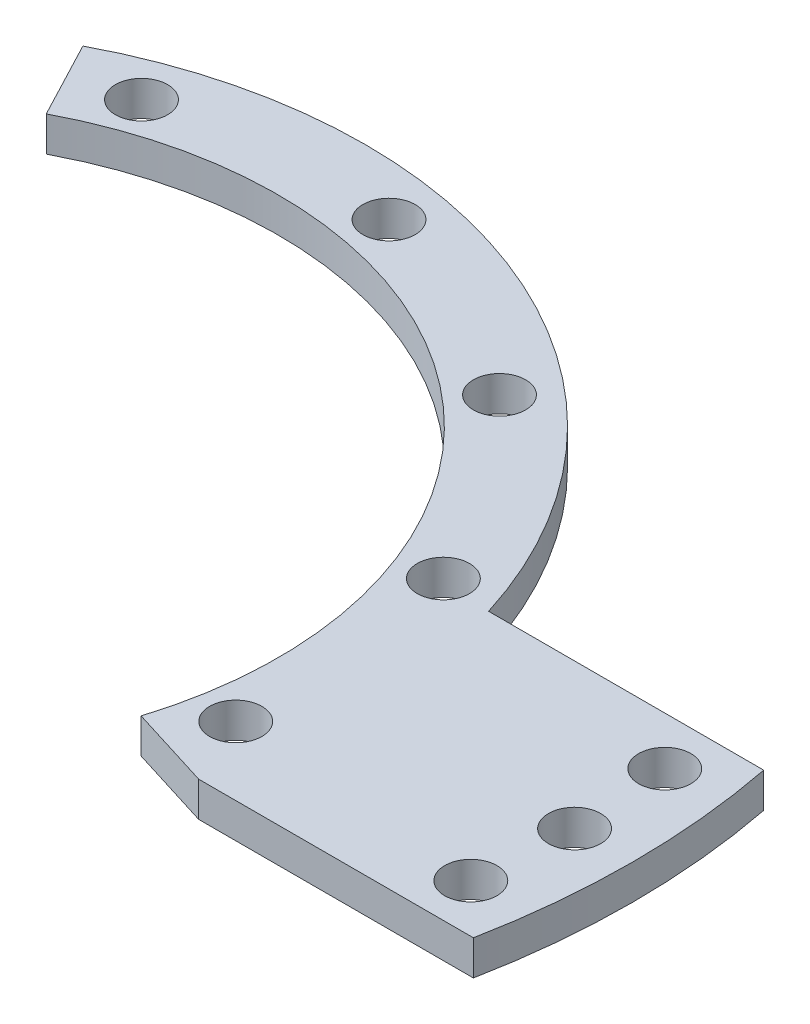
ISO-10303-21;
HEADER;
FILE_DESCRIPTION(('STEP AP214'),'2;1');
FILE_NAME('part.step','',(''),(''),'','','');
FILE_SCHEMA(('AUTOMOTIVE_DESIGN { 1 0 10303 214 1 1 1 1 }'));
ENDSEC;
DATA;
#1=APPLICATION_CONTEXT('core data for automotive mechanical design processes');
#2=APPLICATION_PROTOCOL_DEFINITION('international standard','automotive_design',2000,#1);
#3=PRODUCT_CONTEXT('',#1,'mechanical');
#4=PRODUCT('Part','Part','',(#3));
#5=PRODUCT_RELATED_PRODUCT_CATEGORY('part','',(#4));
#6=PRODUCT_DEFINITION_FORMATION('','',#4);
#7=PRODUCT_DEFINITION_CONTEXT('part definition',#1,'design');
#8=PRODUCT_DEFINITION('design','',#6,#7);
#9=PRODUCT_DEFINITION_SHAPE('','',#8);
#10=(LENGTH_UNIT() NAMED_UNIT(*) SI_UNIT(.MILLI.,.METRE.));
#11=(NAMED_UNIT(*) PLANE_ANGLE_UNIT() SI_UNIT($,.RADIAN.));
#12=(NAMED_UNIT(*) SI_UNIT($,.STERADIAN.) SOLID_ANGLE_UNIT());
#13=UNCERTAINTY_MEASURE_WITH_UNIT(LENGTH_MEASURE(1.E-05),#10,'distance_accuracy_value','');
#14=(GEOMETRIC_REPRESENTATION_CONTEXT(3) GLOBAL_UNCERTAINTY_ASSIGNED_CONTEXT((#13)) GLOBAL_UNIT_ASSIGNED_CONTEXT((#10,
#11,#12)) REPRESENTATION_CONTEXT('',''));
#15=CARTESIAN_POINT('',(0.,0.,0.));
#16=DIRECTION('',(0.,0.,1.));
#17=DIRECTION('',(1.,0.,0.));
#18=AXIS2_PLACEMENT_3D('',#15,#16,#17);
#19=CARTESIAN_POINT('',(0.,3.,0.));
#20=DIRECTION('',(0.,1.,0.));
#21=DIRECTION('',(0.,0.,1.));
#22=AXIS2_PLACEMENT_3D('',#19,#20,#21);
#23=PLANE('',#22);
#24=CARTESIAN_POINT('',(59.4160841244942,3.,-8.35038605760396));
#25=DIRECTION('',(0.,1.,0.));
#26=DIRECTION('',(0.,0.,1.));
#27=AXIS2_PLACEMENT_3D('',#24,#25,#26);
#28=CIRCLE('',#27,2.25);
#29=CARTESIAN_POINT('',(59.4160841244942,3.,-6.10038605760397));
#30=VERTEX_POINT('',#29);
#31=EDGE_CURVE('E163',#30,#30,#28,.T.);
#32=ORIENTED_EDGE('',*,*,#31,.F.);
#33=EDGE_LOOP('',(#32));
#34=FACE_BOUND('',#33,.T.);
#35=CARTESIAN_POINT('',(59.4160841244942,3.,8.35038605760396));
#36=DIRECTION('',(0.,1.,0.));
#37=DIRECTION('',(0.,0.,1.));
#38=AXIS2_PLACEMENT_3D('',#35,#36,#37);
#39=CIRCLE('',#38,2.25);
#40=CARTESIAN_POINT('',(59.4160841244942,3.,10.600386057604));
#41=VERTEX_POINT('',#40);
#42=EDGE_CURVE('E166',#41,#41,#39,.T.);
#43=ORIENTED_EDGE('',*,*,#42,.F.);
#44=EDGE_LOOP('',(#43));
#45=FACE_BOUND('',#44,.T.);
#46=CARTESIAN_POINT('',(60.,3.,0.));
#47=DIRECTION('',(0.,1.,0.));
#48=DIRECTION('',(0.,0.,1.));
#49=AXIS2_PLACEMENT_3D('',#46,#47,#48);
#50=CIRCLE('',#49,2.25);
#51=CARTESIAN_POINT('',(60.,3.,2.25));
#52=VERTEX_POINT('',#51);
#53=EDGE_CURVE('E162',#52,#52,#50,.T.);
#54=ORIENTED_EDGE('',*,*,#53,.F.);
#55=EDGE_LOOP('',(#54));
#56=FACE_BOUND('',#55,.T.);
#57=CARTESIAN_POINT('',(6.59863075134284,3.,-37.422694614464));
#58=DIRECTION('',(0.,1.,0.));
#59=DIRECTION('',(0.,0.,1.));
#60=AXIS2_PLACEMENT_3D('',#57,#58,#59);
#61=CIRCLE('',#60,2.25);
#62=CARTESIAN_POINT('',(6.59863075134284,3.,-35.172694614464));
#63=VERTEX_POINT('',#62);
#64=EDGE_CURVE('E144',#63,#63,#61,.T.);
#65=ORIENTED_EDGE('',*,*,#64,.F.);
#66=EDGE_LOOP('',(#65));
#67=FACE_BOUND('',#66,.T.);
#68=CARTESIAN_POINT('',(24.4259291680881,3.,-29.1096888385215));
#69=DIRECTION('',(0.,1.,0.));
#70=DIRECTION('',(0.,0.,1.));
#71=AXIS2_PLACEMENT_3D('',#68,#69,#70);
#72=CIRCLE('',#71,2.25);
#73=CARTESIAN_POINT('',(24.4259291680881,3.,-26.8596888385215));
#74=VERTEX_POINT('',#73);
#75=EDGE_CURVE('E156',#74,#74,#72,.T.);
#76=ORIENTED_EDGE('',*,*,#75,.F.);
#77=EDGE_LOOP('',(#76));
#78=FACE_BOUND('',#77,.T.);
#79=CARTESIAN_POINT('',(35.7083195898644,3.,-12.9967654463758));
#80=DIRECTION('',(0.,1.,0.));
#81=DIRECTION('',(0.,0.,1.));
#82=AXIS2_PLACEMENT_3D('',#79,#80,#81);
#83=CIRCLE('',#82,2.25);
#84=CARTESIAN_POINT('',(35.7083195898644,3.,-10.7467654463758));
#85=VERTEX_POINT('',#84);
#86=EDGE_CURVE('E152',#85,#85,#83,.T.);
#87=ORIENTED_EDGE('',*,*,#86,.F.);
#88=EDGE_LOOP('',(#87));
#89=FACE_BOUND('',#88,.T.);
#90=CARTESIAN_POINT('',(37.422694614464,3.,6.59863075134298));
#91=DIRECTION('',(0.,1.,0.));
#92=DIRECTION('',(0.,0.,1.));
#93=AXIS2_PLACEMENT_3D('',#90,#91,#92);
#94=CIRCLE('',#93,2.25);
#95=CARTESIAN_POINT('',(37.422694614464,3.,8.84863075134298));
#96=VERTEX_POINT('',#95);
#97=EDGE_CURVE('E148',#96,#96,#94,.T.);
#98=ORIENTED_EDGE('',*,*,#97,.F.);
#99=EDGE_LOOP('',(#98));
#100=FACE_BOUND('',#99,.T.);
#101=CARTESIAN_POINT('',(-12.9967654463754,3.,-35.7083195898645));
#102=DIRECTION('',(0.,1.,0.));
#103=DIRECTION('',(0.,0.,1.));
#104=AXIS2_PLACEMENT_3D('',#101,#102,#103);
#105=CIRCLE('',#104,2.25);
#106=CARTESIAN_POINT('',(-12.9967654463754,3.,-33.4583195898645));
#107=VERTEX_POINT('',#106);
#108=EDGE_CURVE('E143',#107,#107,#105,.T.);
#109=ORIENTED_EDGE('',*,*,#108,.F.);
#110=EDGE_LOOP('',(#109));
#111=FACE_BOUND('',#110,.T.);
#112=DIRECTION('',(1.,0.,0.));
#113=VECTOR('',#112,1.);
#114=CARTESIAN_POINT('',(70.,3.,12.5));
#115=LINE('',#114,#113);
#116=CARTESIAN_POINT('',(40.0967579736816,3.,12.5));
#117=VERTEX_POINT('',#116);
#118=CARTESIAN_POINT('',(63.7867541108654,3.,12.5));
#119=VERTEX_POINT('',#118);
#120=EDGE_CURVE('E110',#117,#119,#115,.T.);
#121=ORIENTED_EDGE('',*,*,#120,.T.);
#122=CARTESIAN_POINT('',(0.,3.,0.));
#123=DIRECTION('',(0.,1.,0.));
#124=DIRECTION('',(0.,0.,1.));
#125=AXIS2_PLACEMENT_3D('',#122,#123,#124);
#126=CIRCLE('',#125,65.);
#127=CARTESIAN_POINT('',(63.7867541108654,3.,-12.5));
#128=VERTEX_POINT('',#127);
#129=EDGE_CURVE('E98',#119,#128,#126,.T.);
#130=ORIENTED_EDGE('',*,*,#129,.T.);
#131=DIRECTION('',(-1.,0.,0.));
#132=VECTOR('',#131,1.);
#133=CARTESIAN_POINT('',(70.,3.,-12.5));
#134=LINE('',#133,#132);
#135=CARTESIAN_POINT('',(40.0967579736816,3.,-12.5));
#136=VERTEX_POINT('',#135);
#137=EDGE_CURVE('E106',#128,#136,#134,.T.);
#138=ORIENTED_EDGE('',*,*,#137,.T.);
#139=CARTESIAN_POINT('',(0.,3.,0.));
#140=DIRECTION('',(0.,1.,0.));
#141=DIRECTION('',(0.,0.,1.));
#142=AXIS2_PLACEMENT_3D('',#139,#140,#141);
#143=CIRCLE('',#142,42.);
#144=CARTESIAN_POINT('',(-19.5233659204339,3.,-37.1865322816855));
#145=VERTEX_POINT('',#144);
#146=EDGE_CURVE('E136',#136,#145,#143,.T.);
#147=ORIENTED_EDGE('',*,*,#146,.T.);
#148=DIRECTION('',(-0.464842045724618,0.,-0.885393625754417));
#149=VECTOR('',#148,1.);
#150=CARTESIAN_POINT('',(0.,3.,0.));
#151=LINE('',#150,#149);
#152=CARTESIAN_POINT('',(-16.0370505774993,3.,-30.5460800885274));
#153=VERTEX_POINT('',#152);
#154=EDGE_CURVE('E210',#153,#145,#151,.T.);
#155=ORIENTED_EDGE('',*,*,#154,.F.);
#156=CARTESIAN_POINT('',(0.,3.,0.));
#157=DIRECTION('',(0.,1.,0.));
#158=DIRECTION('',(0.,0.,1.));
#159=AXIS2_PLACEMENT_3D('',#156,#157,#158);
#160=CIRCLE('',#159,34.5);
#161=CARTESIAN_POINT('',(32.9392475828465,3.,10.2594331556836));
#162=VERTEX_POINT('',#161);
#163=EDGE_CURVE('E127',#162,#153,#160,.T.);
#164=ORIENTED_EDGE('',*,*,#163,.F.);
#165=DIRECTION('',(-0.954760799502797,0.,-0.297374874077787));
#166=VECTOR('',#165,1.);
#167=CARTESIAN_POINT('',(0.,3.,0.));
#168=LINE('',#167,#166);
#169=CARTESIAN_POINT('',(40.0999535791175,3.,12.489744711267));
#170=VERTEX_POINT('',#169);
#171=EDGE_CURVE('E206',#170,#162,#168,.T.);
#172=ORIENTED_EDGE('',*,*,#171,.F.);
#173=CARTESIAN_POINT('',(0.,3.,0.));
#174=DIRECTION('',(0.,1.,0.));
#175=DIRECTION('',(0.,0.,1.));
#176=AXIS2_PLACEMENT_3D('',#173,#174,#175);
#177=CIRCLE('',#176,42.);
#178=EDGE_CURVE('E214',#117,#170,#177,.T.);
#179=ORIENTED_EDGE('',*,*,#178,.F.);
#180=EDGE_LOOP('',(#121,#130,#138,#147,#155,#164,#172,#179));
#181=FACE_BOUND('',#180,.T.);
#182=ADVANCED_FACE('F33',(#34,#45,#56,#67,#78,#89,#100,#111,#181),#23,.T.);
#183=CARTESIAN_POINT('',(0.,0.,0.));
#184=DIRECTION('',(0.,1.,0.));
#185=DIRECTION('',(0.,0.,1.));
#186=AXIS2_PLACEMENT_3D('',#183,#184,#185);
#187=PLANE('',#186);
#188=CARTESIAN_POINT('',(59.4160841244942,0.,-8.35038605760396));
#189=DIRECTION('',(0.,1.,0.));
#190=DIRECTION('',(0.,0.,1.));
#191=AXIS2_PLACEMENT_3D('',#188,#189,#190);
#192=CIRCLE('',#191,2.25);
#193=CARTESIAN_POINT('',(59.4160841244942,0.,-6.10038605760397));
#194=VERTEX_POINT('',#193);
#195=EDGE_CURVE('E37',#194,#194,#192,.T.);
#196=ORIENTED_EDGE('',*,*,#195,.T.);
#197=EDGE_LOOP('',(#196));
#198=FACE_BOUND('',#197,.T.);
#199=CARTESIAN_POINT('',(59.4160841244942,0.,8.35038605760396));
#200=DIRECTION('',(0.,1.,0.));
#201=DIRECTION('',(0.,0.,1.));
#202=AXIS2_PLACEMENT_3D('',#199,#200,#201);
#203=CIRCLE('',#202,2.25);
#204=CARTESIAN_POINT('',(59.4160841244942,0.,10.600386057604));
#205=VERTEX_POINT('',#204);
#206=EDGE_CURVE('E164',#205,#205,#203,.T.);
#207=ORIENTED_EDGE('',*,*,#206,.T.);
#208=EDGE_LOOP('',(#207));
#209=FACE_BOUND('',#208,.T.);
#210=CARTESIAN_POINT('',(60.,0.,0.));
#211=DIRECTION('',(0.,1.,0.));
#212=DIRECTION('',(0.,0.,1.));
#213=AXIS2_PLACEMENT_3D('',#210,#211,#212);
#214=CIRCLE('',#213,2.25);
#215=CARTESIAN_POINT('',(60.,0.,2.25));
#216=VERTEX_POINT('',#215);
#217=EDGE_CURVE('E160',#216,#216,#214,.T.);
#218=ORIENTED_EDGE('',*,*,#217,.T.);
#219=EDGE_LOOP('',(#218));
#220=FACE_BOUND('',#219,.T.);
#221=CARTESIAN_POINT('',(-12.9967654463754,0.,-35.7083195898645));
#222=DIRECTION('',(0.,1.,0.));
#223=DIRECTION('',(0.,0.,1.));
#224=AXIS2_PLACEMENT_3D('',#221,#222,#223);
#225=CIRCLE('',#224,2.25);
#226=CARTESIAN_POINT('',(-12.9967654463754,0.,-33.4583195898645));
#227=VERTEX_POINT('',#226);
#228=EDGE_CURVE('E140',#227,#227,#225,.T.);
#229=ORIENTED_EDGE('',*,*,#228,.T.);
#230=EDGE_LOOP('',(#229));
#231=FACE_BOUND('',#230,.T.);
#232=CARTESIAN_POINT('',(37.422694614464,0.,6.59863075134298));
#233=DIRECTION('',(0.,1.,0.));
#234=DIRECTION('',(0.,0.,1.));
#235=AXIS2_PLACEMENT_3D('',#232,#233,#234);
#236=CIRCLE('',#235,2.25);
#237=CARTESIAN_POINT('',(37.422694614464,0.,8.84863075134298));
#238=VERTEX_POINT('',#237);
#239=EDGE_CURVE('E145',#238,#238,#236,.T.);
#240=ORIENTED_EDGE('',*,*,#239,.T.);
#241=EDGE_LOOP('',(#240));
#242=FACE_BOUND('',#241,.T.);
#243=CARTESIAN_POINT('',(35.7083195898644,0.,-12.9967654463758));
#244=DIRECTION('',(0.,1.,0.));
#245=DIRECTION('',(0.,0.,1.));
#246=AXIS2_PLACEMENT_3D('',#243,#244,#245);
#247=CIRCLE('',#246,2.25);
#248=CARTESIAN_POINT('',(35.7083195898644,0.,-10.7467654463758));
#249=VERTEX_POINT('',#248);
#250=EDGE_CURVE('E149',#249,#249,#247,.T.);
#251=ORIENTED_EDGE('',*,*,#250,.T.);
#252=EDGE_LOOP('',(#251));
#253=FACE_BOUND('',#252,.T.);
#254=CARTESIAN_POINT('',(24.4259291680881,0.,-29.1096888385215));
#255=DIRECTION('',(0.,1.,0.));
#256=DIRECTION('',(0.,0.,1.));
#257=AXIS2_PLACEMENT_3D('',#254,#255,#256);
#258=CIRCLE('',#257,2.25);
#259=CARTESIAN_POINT('',(24.4259291680881,0.,-26.8596888385215));
#260=VERTEX_POINT('',#259);
#261=EDGE_CURVE('E153',#260,#260,#258,.T.);
#262=ORIENTED_EDGE('',*,*,#261,.T.);
#263=EDGE_LOOP('',(#262));
#264=FACE_BOUND('',#263,.T.);
#265=CARTESIAN_POINT('',(6.59863075134284,0.,-37.422694614464));
#266=DIRECTION('',(0.,1.,0.));
#267=DIRECTION('',(0.,0.,1.));
#268=AXIS2_PLACEMENT_3D('',#265,#266,#267);
#269=CIRCLE('',#268,2.25);
#270=CARTESIAN_POINT('',(6.59863075134284,0.,-35.172694614464));
#271=VERTEX_POINT('',#270);
#272=EDGE_CURVE('E157',#271,#271,#269,.T.);
#273=ORIENTED_EDGE('',*,*,#272,.T.);
#274=EDGE_LOOP('',(#273));
#275=FACE_BOUND('',#274,.T.);
#276=CARTESIAN_POINT('',(0.,0.,0.));
#277=DIRECTION('',(0.,1.,0.));
#278=DIRECTION('',(0.,0.,1.));
#279=AXIS2_PLACEMENT_3D('',#276,#277,#278);
#280=CIRCLE('',#279,65.);
#281=CARTESIAN_POINT('',(63.7867541108654,0.,12.5));
#282=VERTEX_POINT('',#281);
#283=CARTESIAN_POINT('',(63.7867541108654,0.,-12.5));
#284=VERTEX_POINT('',#283);
#285=EDGE_CURVE('E49',#282,#284,#280,.T.);
#286=ORIENTED_EDGE('',*,*,#285,.F.);
#287=DIRECTION('',(1.,0.,0.));
#288=VECTOR('',#287,1.);
#289=CARTESIAN_POINT('',(70.,0.,12.5));
#290=LINE('',#289,#288);
#291=CARTESIAN_POINT('',(40.0967579736816,0.,12.5));
#292=VERTEX_POINT('',#291);
#293=EDGE_CURVE('E124',#292,#282,#290,.T.);
#294=ORIENTED_EDGE('',*,*,#293,.F.);
#295=CARTESIAN_POINT('',(0.,0.,0.));
#296=DIRECTION('',(0.,1.,0.));
#297=DIRECTION('',(0.,0.,-1.));
#298=AXIS2_PLACEMENT_3D('',#295,#296,#297);
#299=CIRCLE('',#298,42.);
#300=CARTESIAN_POINT('',(40.0999535791175,0.,12.489744711267));
#301=VERTEX_POINT('',#300);
#302=EDGE_CURVE('E192',#292,#301,#299,.T.);
#303=ORIENTED_EDGE('',*,*,#302,.T.);
#304=DIRECTION('',(-0.954760799502797,0.,-0.297374874077787));
#305=VECTOR('',#304,1.);
#306=CARTESIAN_POINT('',(0.,0.,0.));
#307=LINE('',#306,#305);
#308=CARTESIAN_POINT('',(32.9392475828465,0.,10.2594331556836));
#309=VERTEX_POINT('',#308);
#310=EDGE_CURVE('E195',#301,#309,#307,.T.);
#311=ORIENTED_EDGE('',*,*,#310,.T.);
#312=CARTESIAN_POINT('',(0.,0.,0.));
#313=DIRECTION('',(0.,1.,0.));
#314=DIRECTION('',(0.,0.,1.));
#315=AXIS2_PLACEMENT_3D('',#312,#313,#314);
#316=CIRCLE('',#315,34.5);
#317=CARTESIAN_POINT('',(-16.0370505774993,0.,-30.5460800885274));
#318=VERTEX_POINT('',#317);
#319=EDGE_CURVE('E220',#309,#318,#316,.T.);
#320=ORIENTED_EDGE('',*,*,#319,.T.);
#321=DIRECTION('',(-0.464842045724618,0.,-0.885393625754417));
#322=VECTOR('',#321,1.);
#323=CARTESIAN_POINT('',(-19.5233659204339,0.,-37.1865322816855));
#324=LINE('',#323,#322);
#325=CARTESIAN_POINT('',(-19.5233659204339,0.,-37.1865322816855));
#326=VERTEX_POINT('',#325);
#327=EDGE_CURVE('E57',#318,#326,#324,.T.);
#328=ORIENTED_EDGE('',*,*,#327,.T.);
#329=CARTESIAN_POINT('',(0.,0.,0.));
#330=DIRECTION('',(0.,1.,0.));
#331=DIRECTION('',(0.,0.,1.));
#332=AXIS2_PLACEMENT_3D('',#329,#330,#331);
#333=CIRCLE('',#332,42.);
#334=CARTESIAN_POINT('',(40.0967579736816,0.,-12.5));
#335=VERTEX_POINT('',#334);
#336=EDGE_CURVE('E131',#335,#326,#333,.T.);
#337=ORIENTED_EDGE('',*,*,#336,.F.);
#338=DIRECTION('',(-1.,0.,0.));
#339=VECTOR('',#338,1.);
#340=CARTESIAN_POINT('',(70.,0.,-12.5));
#341=LINE('',#340,#339);
#342=EDGE_CURVE('E120',#284,#335,#341,.T.);
#343=ORIENTED_EDGE('',*,*,#342,.F.);
#344=EDGE_LOOP('',(#286,#294,#303,#311,#320,#328,#337,#343));
#345=FACE_BOUND('',#344,.T.);
#346=ADVANCED_FACE('F235',(#198,#209,#220,#231,#242,#253,#264,#275,#345),#187,.F.);
#347=CARTESIAN_POINT('',(70.,3.,12.5));
#348=DIRECTION('',(0.,0.,-1.));
#349=DIRECTION('',(-1.,0.,0.));
#350=AXIS2_PLACEMENT_3D('',#347,#348,#349);
#351=PLANE('',#350);
#352=DIRECTION('',(0.,1.,0.));
#353=VECTOR('',#352,1.);
#354=CARTESIAN_POINT('',(63.7867541108654,-2.5E-05,12.5));
#355=LINE('',#354,#353);
#356=EDGE_CURVE('E111',#119,#282,#355,.F.);
#357=ORIENTED_EDGE('',*,*,#356,.F.);
#358=ORIENTED_EDGE('',*,*,#120,.F.);
#359=DIRECTION('',(0.,-1.,0.));
#360=VECTOR('',#359,1.);
#361=CARTESIAN_POINT('',(40.0967579736816,3.,12.5));
#362=LINE('',#361,#360);
#363=EDGE_CURVE('E118',#117,#292,#362,.T.);
#364=ORIENTED_EDGE('',*,*,#363,.T.);
#365=ORIENTED_EDGE('',*,*,#293,.T.);
#366=EDGE_LOOP('',(#357,#358,#364,#365));
#367=FACE_BOUND('',#366,.T.);
#368=ADVANCED_FACE('F243',(#367),#351,.F.);
#369=CARTESIAN_POINT('',(70.,3.,-12.5));
#370=DIRECTION('',(0.,0.,1.));
#371=DIRECTION('',(1.,0.,0.));
#372=AXIS2_PLACEMENT_3D('',#369,#370,#371);
#373=PLANE('',#372);
#374=DIRECTION('',(0.,1.,0.));
#375=VECTOR('',#374,1.);
#376=CARTESIAN_POINT('',(63.7867541108654,-2.5E-05,-12.5));
#377=LINE('',#376,#375);
#378=EDGE_CURVE('E11',#284,#128,#377,.T.);
#379=ORIENTED_EDGE('',*,*,#378,.F.);
#380=ORIENTED_EDGE('',*,*,#342,.T.);
#381=DIRECTION('',(0.,-1.,0.));
#382=VECTOR('',#381,1.);
#383=CARTESIAN_POINT('',(40.0967579736816,3.,-12.5));
#384=LINE('',#383,#382);
#385=EDGE_CURVE('E116',#335,#136,#384,.F.);
#386=ORIENTED_EDGE('',*,*,#385,.T.);
#387=ORIENTED_EDGE('',*,*,#137,.F.);
#388=EDGE_LOOP('',(#379,#380,#386,#387));
#389=FACE_BOUND('',#388,.T.);
#390=ADVANCED_FACE('F114',(#389),#373,.F.);
#391=CARTESIAN_POINT('',(0.,3.,0.));
#392=DIRECTION('',(0.,-1.,0.));
#393=DIRECTION('',(0.,0.,-1.));
#394=AXIS2_PLACEMENT_3D('',#391,#392,#393);
#395=CYLINDRICAL_SURFACE('',#394,42.);
#396=ORIENTED_EDGE('',*,*,#336,.T.);
#397=DIRECTION('',(0.,1.,0.));
#398=VECTOR('',#397,1.);
#399=CARTESIAN_POINT('',(-19.5233659204339,0.,-37.1865322816855));
#400=LINE('',#399,#398);
#401=EDGE_CURVE('E198',#326,#145,#400,.T.);
#402=ORIENTED_EDGE('',*,*,#401,.T.);
#403=ORIENTED_EDGE('',*,*,#146,.F.);
#404=ORIENTED_EDGE('',*,*,#385,.F.);
#405=EDGE_LOOP('',(#396,#402,#403,#404));
#406=FACE_BOUND('',#405,.T.);
#407=ADVANCED_FACE('F35',(#406),#395,.T.);
#408=CARTESIAN_POINT('',(0.,0.,0.));
#409=DIRECTION('',(0.,1.,0.));
#410=DIRECTION('',(0.,0.,1.));
#411=AXIS2_PLACEMENT_3D('',#408,#409,#410);
#412=CYLINDRICAL_SURFACE('',#411,34.5);
#413=ORIENTED_EDGE('',*,*,#163,.T.);
#414=DIRECTION('',(0.,1.,0.));
#415=VECTOR('',#414,1.);
#416=CARTESIAN_POINT('',(-16.0370505774993,0.,-30.5460800885274));
#417=LINE('',#416,#415);
#418=EDGE_CURVE('E42',#153,#318,#417,.F.);
#419=ORIENTED_EDGE('',*,*,#418,.T.);
#420=ORIENTED_EDGE('',*,*,#319,.F.);
#421=DIRECTION('',(0.,1.,0.));
#422=VECTOR('',#421,1.);
#423=CARTESIAN_POINT('',(32.9392475828465,0.,10.2594331556836));
#424=LINE('',#423,#422);
#425=EDGE_CURVE('E139',#309,#162,#424,.T.);
#426=ORIENTED_EDGE('',*,*,#425,.T.);
#427=EDGE_LOOP('',(#413,#419,#420,#426));
#428=FACE_BOUND('',#427,.T.);
#429=ADVANCED_FACE('F226',(#428),#412,.F.);
#430=CARTESIAN_POINT('',(0.,0.,0.));
#431=DIRECTION('',(0.297374874077787,0.,-0.954760799502797));
#432=DIRECTION('',(-0.954760799502797,0.,-0.297374874077787));
#433=AXIS2_PLACEMENT_3D('',#430,#431,#432);
#434=PLANE('',#433);
#435=ORIENTED_EDGE('',*,*,#171,.T.);
#436=ORIENTED_EDGE('',*,*,#425,.F.);
#437=ORIENTED_EDGE('',*,*,#310,.F.);
#438=DIRECTION('',(0.,1.,0.));
#439=VECTOR('',#438,1.);
#440=CARTESIAN_POINT('',(40.0999535791175,0.,12.489744711267));
#441=LINE('',#440,#439);
#442=EDGE_CURVE('E201',#301,#170,#441,.T.);
#443=ORIENTED_EDGE('',*,*,#442,.T.);
#444=EDGE_LOOP('',(#435,#436,#437,#443));
#445=FACE_BOUND('',#444,.T.);
#446=ADVANCED_FACE('F239',(#445),#434,.F.);
#447=CARTESIAN_POINT('',(0.,0.,0.));
#448=DIRECTION('',(0.,1.,0.));
#449=DIRECTION('',(0.,0.,1.));
#450=AXIS2_PLACEMENT_3D('',#447,#448,#449);
#451=CYLINDRICAL_SURFACE('',#450,42.);
#452=ORIENTED_EDGE('',*,*,#178,.T.);
#453=ORIENTED_EDGE('',*,*,#442,.F.);
#454=ORIENTED_EDGE('',*,*,#302,.F.);
#455=ORIENTED_EDGE('',*,*,#363,.F.);
#456=EDGE_LOOP('',(#452,#453,#454,#455));
#457=FACE_BOUND('',#456,.T.);
#458=ADVANCED_FACE('F241',(#457),#451,.F.);
#459=CARTESIAN_POINT('',(-19.5233659204339,0.,-37.1865322816855));
#460=DIRECTION('',(0.885393625754417,0.,-0.464842045724618));
#461=DIRECTION('',(-0.464842045724618,0.,-0.885393625754417));
#462=AXIS2_PLACEMENT_3D('',#459,#460,#461);
#463=PLANE('',#462);
#464=ORIENTED_EDGE('',*,*,#154,.T.);
#465=ORIENTED_EDGE('',*,*,#401,.F.);
#466=ORIENTED_EDGE('',*,*,#327,.F.);
#467=ORIENTED_EDGE('',*,*,#418,.F.);
#468=EDGE_LOOP('',(#464,#465,#466,#467));
#469=FACE_BOUND('',#468,.T.);
#470=ADVANCED_FACE('F230',(#469),#463,.F.);
#471=CARTESIAN_POINT('',(-12.9967654463754,-2.49999999998515E-05,-35.7083195898645));
#472=DIRECTION('',(0.,1.,0.));
#473=DIRECTION('',(0.,0.,1.));
#474=AXIS2_PLACEMENT_3D('',#471,#472,#473);
#475=CYLINDRICAL_SURFACE('',#474,2.25);
#476=ORIENTED_EDGE('',*,*,#108,.T.);
#477=EDGE_LOOP('',(#476));
#478=FACE_BOUND('',#477,.T.);
#479=ORIENTED_EDGE('',*,*,#228,.F.);
#480=EDGE_LOOP('',(#479));
#481=FACE_BOUND('',#480,.T.);
#482=ADVANCED_FACE('F272',(#478,#481),#475,.F.);
#483=CARTESIAN_POINT('',(37.422694614464,-2.49999999998515E-05,6.59863075134298));
#484=DIRECTION('',(0.,1.,0.));
#485=DIRECTION('',(0.,0.,1.));
#486=AXIS2_PLACEMENT_3D('',#483,#484,#485);
#487=CYLINDRICAL_SURFACE('',#486,2.25);
#488=ORIENTED_EDGE('',*,*,#97,.T.);
#489=EDGE_LOOP('',(#488));
#490=FACE_BOUND('',#489,.T.);
#491=ORIENTED_EDGE('',*,*,#239,.F.);
#492=EDGE_LOOP('',(#491));
#493=FACE_BOUND('',#492,.T.);
#494=ADVANCED_FACE('F275',(#490,#493),#487,.F.);
#495=CARTESIAN_POINT('',(35.7083195898644,-2.49999999998515E-05,-12.9967654463758));
#496=DIRECTION('',(0.,1.,0.));
#497=DIRECTION('',(0.,0.,1.));
#498=AXIS2_PLACEMENT_3D('',#495,#496,#497);
#499=CYLINDRICAL_SURFACE('',#498,2.25);
#500=ORIENTED_EDGE('',*,*,#86,.T.);
#501=EDGE_LOOP('',(#500));
#502=FACE_BOUND('',#501,.T.);
#503=ORIENTED_EDGE('',*,*,#250,.F.);
#504=EDGE_LOOP('',(#503));
#505=FACE_BOUND('',#504,.T.);
#506=ADVANCED_FACE('F299',(#502,#505),#499,.F.);
#507=CARTESIAN_POINT('',(24.4259291680881,-2.49999999998515E-05,-29.1096888385215));
#508=DIRECTION('',(0.,1.,0.));
#509=DIRECTION('',(0.,0.,1.));
#510=AXIS2_PLACEMENT_3D('',#507,#508,#509);
#511=CYLINDRICAL_SURFACE('',#510,2.25);
#512=ORIENTED_EDGE('',*,*,#75,.T.);
#513=EDGE_LOOP('',(#512));
#514=FACE_BOUND('',#513,.T.);
#515=ORIENTED_EDGE('',*,*,#261,.F.);
#516=EDGE_LOOP('',(#515));
#517=FACE_BOUND('',#516,.T.);
#518=ADVANCED_FACE('F290',(#514,#517),#511,.F.);
#519=CARTESIAN_POINT('',(6.59863075134284,-2.49999999998515E-05,-37.422694614464));
#520=DIRECTION('',(0.,1.,0.));
#521=DIRECTION('',(0.,0.,1.));
#522=AXIS2_PLACEMENT_3D('',#519,#520,#521);
#523=CYLINDRICAL_SURFACE('',#522,2.25);
#524=ORIENTED_EDGE('',*,*,#64,.T.);
#525=EDGE_LOOP('',(#524));
#526=FACE_BOUND('',#525,.T.);
#527=ORIENTED_EDGE('',*,*,#272,.F.);
#528=EDGE_LOOP('',(#527));
#529=FACE_BOUND('',#528,.T.);
#530=ADVANCED_FACE('F288',(#526,#529),#523,.F.);
#531=CARTESIAN_POINT('',(0.,-2.5E-05,0.));
#532=DIRECTION('',(0.,1.,0.));
#533=DIRECTION('',(0.,0.,1.));
#534=AXIS2_PLACEMENT_3D('',#531,#532,#533);
#535=CYLINDRICAL_SURFACE('',#534,65.);
#536=ORIENTED_EDGE('',*,*,#356,.T.);
#537=ORIENTED_EDGE('',*,*,#285,.T.);
#538=ORIENTED_EDGE('',*,*,#378,.T.);
#539=ORIENTED_EDGE('',*,*,#129,.F.);
#540=EDGE_LOOP('',(#536,#537,#538,#539));
#541=FACE_BOUND('',#540,.T.);
#542=ADVANCED_FACE('F97',(#541),#535,.T.);
#543=CARTESIAN_POINT('',(60.,-2.49999999998515E-05,0.));
#544=DIRECTION('',(0.,1.,0.));
#545=DIRECTION('',(0.,0.,1.));
#546=AXIS2_PLACEMENT_3D('',#543,#544,#545);
#547=CYLINDRICAL_SURFACE('',#546,2.25);
#548=ORIENTED_EDGE('',*,*,#53,.T.);
#549=EDGE_LOOP('',(#548));
#550=FACE_BOUND('',#549,.T.);
#551=ORIENTED_EDGE('',*,*,#217,.F.);
#552=EDGE_LOOP('',(#551));
#553=FACE_BOUND('',#552,.T.);
#554=ADVANCED_FACE('F297',(#550,#553),#547,.F.);
#555=CARTESIAN_POINT('',(59.4160841244942,-2.49999999998515E-05,8.35038605760396));
#556=DIRECTION('',(0.,1.,0.));
#557=DIRECTION('',(0.,0.,1.));
#558=AXIS2_PLACEMENT_3D('',#555,#556,#557);
#559=CYLINDRICAL_SURFACE('',#558,2.25);
#560=ORIENTED_EDGE('',*,*,#42,.T.);
#561=EDGE_LOOP('',(#560));
#562=FACE_BOUND('',#561,.T.);
#563=ORIENTED_EDGE('',*,*,#206,.F.);
#564=EDGE_LOOP('',(#563));
#565=FACE_BOUND('',#564,.T.);
#566=ADVANCED_FACE('F338',(#562,#565),#559,.F.);
#567=CARTESIAN_POINT('',(59.4160841244942,-2.49999999998515E-05,-8.35038605760396));
#568=DIRECTION('',(0.,1.,0.));
#569=DIRECTION('',(0.,0.,1.));
#570=AXIS2_PLACEMENT_3D('',#567,#568,#569);
#571=CYLINDRICAL_SURFACE('',#570,2.25);
#572=ORIENTED_EDGE('',*,*,#31,.T.);
#573=EDGE_LOOP('',(#572));
#574=FACE_BOUND('',#573,.T.);
#575=ORIENTED_EDGE('',*,*,#195,.F.);
#576=EDGE_LOOP('',(#575));
#577=FACE_BOUND('',#576,.T.);
#578=ADVANCED_FACE('F360',(#574,#577),#571,.F.);
#579=CLOSED_SHELL('',(#182,#346,#368,#390,#407,#429,#446,#458,#470,#482,#494,#506,#518,#530,
#542,#554,#566,#578));
#580=MANIFOLD_SOLID_BREP('B2',#579);
#581=ADVANCED_BREP_SHAPE_REPRESENTATION('',(#18,#580),#14);
#582=SHAPE_DEFINITION_REPRESENTATION(#9,#581);
ENDSEC;
END-ISO-10303-21;
